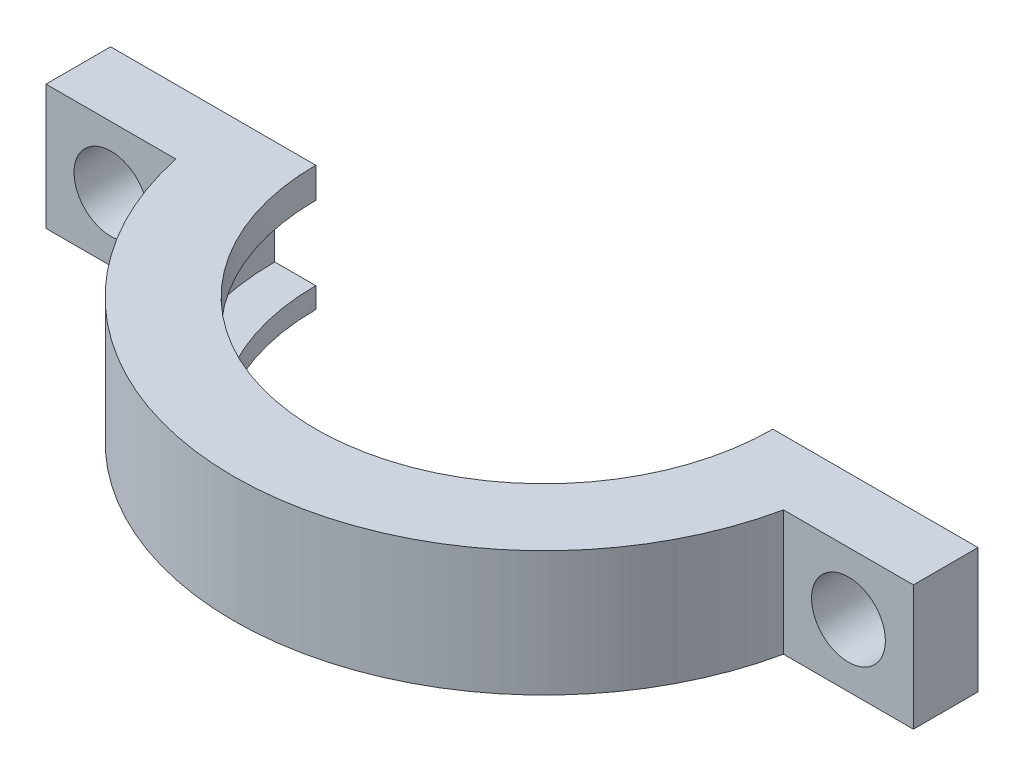
ISO-10303-21;
HEADER;
FILE_DESCRIPTION(('STEP AP214'),'2;1');
FILE_NAME('part.step','',(''),(''),'','','');
FILE_SCHEMA(('AUTOMOTIVE_DESIGN { 1 0 10303 214 1 1 1 1 }'));
ENDSEC;
DATA;
#1=APPLICATION_CONTEXT('core data for automotive mechanical design processes');
#2=APPLICATION_PROTOCOL_DEFINITION('international standard','automotive_design',2000,#1);
#3=PRODUCT_CONTEXT('',#1,'mechanical');
#4=PRODUCT('Part','Part','',(#3));
#5=PRODUCT_RELATED_PRODUCT_CATEGORY('part','',(#4));
#6=PRODUCT_DEFINITION_FORMATION('','',#4);
#7=PRODUCT_DEFINITION_CONTEXT('part definition',#1,'design');
#8=PRODUCT_DEFINITION('design','',#6,#7);
#9=PRODUCT_DEFINITION_SHAPE('','',#8);
#10=(LENGTH_UNIT() NAMED_UNIT(*) SI_UNIT(.MILLI.,.METRE.));
#11=(NAMED_UNIT(*) PLANE_ANGLE_UNIT() SI_UNIT($,.RADIAN.));
#12=(NAMED_UNIT(*) SI_UNIT($,.STERADIAN.) SOLID_ANGLE_UNIT());
#13=UNCERTAINTY_MEASURE_WITH_UNIT(LENGTH_MEASURE(1.E-05),#10,'distance_accuracy_value','');
#14=(GEOMETRIC_REPRESENTATION_CONTEXT(3) GLOBAL_UNCERTAINTY_ASSIGNED_CONTEXT((#13)) GLOBAL_UNIT_ASSIGNED_CONTEXT((#10,
#11,#12)) REPRESENTATION_CONTEXT('',''));
#15=CARTESIAN_POINT('',(0.,0.,0.));
#16=DIRECTION('',(0.,0.,1.));
#17=DIRECTION('',(1.,0.,0.));
#18=AXIS2_PLACEMENT_3D('',#15,#16,#17);
#19=CARTESIAN_POINT('',(-49.7442644411717,0.,0.));
#20=DIRECTION('',(0.,-1.,0.));
#21=DIRECTION('',(0.,0.,-1.));
#22=AXIS2_PLACEMENT_3D('',#19,#20,#21);
#23=CYLINDRICAL_SURFACE('',#22,15.1402673023807);
#24=CARTESIAN_POINT('',(-49.7442644411717,11.7337288164038,0.));
#25=DIRECTION('',(0.,-1.,0.));
#26=DIRECTION('',(0.,0.,-1.));
#27=AXIS2_PLACEMENT_3D('',#24,#25,#26);
#28=CIRCLE('',#27,15.1402673023807);
#29=CARTESIAN_POINT('',(-34.9353078949616,11.7337288164038,3.15000000000001));
#30=VERTEX_POINT('',#29);
#31=CARTESIAN_POINT('',(-64.5532209873817,11.7337288164038,3.15));
#32=VERTEX_POINT('',#31);
#33=EDGE_CURVE('E12',#30,#32,#28,.T.);
#34=ORIENTED_EDGE('',*,*,#33,.T.);
#35=DIRECTION('',(0.,1.,0.));
#36=VECTOR('',#35,1.);
#37=CARTESIAN_POINT('',(-64.5532209873817,-3.29191368207121,3.15));
#38=LINE('',#37,#36);
#39=CARTESIAN_POINT('',(-64.5532209873817,5.63979924945554,3.15));
#40=VERTEX_POINT('',#39);
#41=EDGE_CURVE('E176',#40,#32,#38,.T.);
#42=ORIENTED_EDGE('',*,*,#41,.F.);
#43=CARTESIAN_POINT('',(-49.7442644411717,5.63979924945554,0.));
#44=DIRECTION('',(0.,-1.,0.));
#45=DIRECTION('',(0.,0.,-1.));
#46=AXIS2_PLACEMENT_3D('',#43,#44,#45);
#47=CIRCLE('',#46,15.1402673023807);
#48=CARTESIAN_POINT('',(-34.9353078949616,5.63979924945554,3.15000000000001));
#49=VERTEX_POINT('',#48);
#50=EDGE_CURVE('E57',#49,#40,#47,.T.);
#51=ORIENTED_EDGE('',*,*,#50,.F.);
#52=DIRECTION('',(0.,1.,0.));
#53=VECTOR('',#52,1.);
#54=CARTESIAN_POINT('',(-34.9353078949616,-3.29191368207121,3.15000000000001));
#55=LINE('',#54,#53);
#56=EDGE_CURVE('E188',#49,#30,#55,.T.);
#57=ORIENTED_EDGE('',*,*,#56,.T.);
#58=EDGE_LOOP('',(#34,#42,#51,#57));
#59=FACE_BOUND('',#58,.T.);
#60=ADVANCED_FACE('F47',(#59),#23,.T.);
#61=CARTESIAN_POINT('',(-28.603997138791,-3.29191368207121,3.15000000000001));
#62=DIRECTION('',(1.,0.,0.));
#63=DIRECTION('',(0.,0.,-1.));
#64=AXIS2_PLACEMENT_3D('',#61,#62,#63);
#65=PLANE('',#64);
#66=DIRECTION('',(0.,-1.,0.));
#67=VECTOR('',#66,1.);
#68=CARTESIAN_POINT('',(-28.603997138791,-3.29191368207121,0.));
#69=LINE('',#68,#67);
#70=CARTESIAN_POINT('',(-28.603997138791,11.7337288164038,0.));
#71=VERTEX_POINT('',#70);
#72=CARTESIAN_POINT('',(-28.603997138791,5.63979924945554,0.));
#73=VERTEX_POINT('',#72);
#74=EDGE_CURVE('E239',#71,#73,#69,.T.);
#75=ORIENTED_EDGE('',*,*,#74,.F.);
#76=DIRECTION('',(0.,0.,-1.));
#77=VECTOR('',#76,1.);
#78=CARTESIAN_POINT('',(-28.603997138791,11.7337288164038,3.15000000000001));
#79=LINE('',#78,#77);
#80=CARTESIAN_POINT('',(-28.603997138791,11.7337288164038,3.15000000000001));
#81=VERTEX_POINT('',#80);
#82=EDGE_CURVE('E170',#81,#71,#79,.T.);
#83=ORIENTED_EDGE('',*,*,#82,.F.);
#84=DIRECTION('',(0.,1.,0.));
#85=VECTOR('',#84,1.);
#86=CARTESIAN_POINT('',(-28.603997138791,-3.29191368207121,3.15000000000001));
#87=LINE('',#86,#85);
#88=CARTESIAN_POINT('',(-28.603997138791,5.63979924945554,3.15000000000001));
#89=VERTEX_POINT('',#88);
#90=EDGE_CURVE('E192',#89,#81,#87,.T.);
#91=ORIENTED_EDGE('',*,*,#90,.F.);
#92=DIRECTION('',(0.,0.,1.));
#93=VECTOR('',#92,1.);
#94=CARTESIAN_POINT('',(-28.603997138791,5.63979924945554,3.15000000000001));
#95=LINE('',#94,#93);
#96=EDGE_CURVE('E186',#73,#89,#95,.T.);
#97=ORIENTED_EDGE('',*,*,#96,.F.);
#98=EDGE_LOOP('',(#75,#83,#91,#97));
#99=FACE_BOUND('',#98,.T.);
#100=ADVANCED_FACE('F238',(#99),#65,.T.);
#101=CARTESIAN_POINT('',(-49.7442644411717,0.,0.));
#102=DIRECTION('',(0.,-1.,0.));
#103=DIRECTION('',(0.,0.,-1.));
#104=AXIS2_PLACEMENT_3D('',#101,#102,#103);
#105=CYLINDRICAL_SURFACE('',#104,11.1402673023807);
#106=CARTESIAN_POINT('',(-49.7442644411717,10.2506791032564,0.));
#107=DIRECTION('',(0.,-1.,0.));
#108=DIRECTION('',(0.,0.,-1.));
#109=AXIS2_PLACEMENT_3D('',#106,#107,#108);
#110=CIRCLE('',#109,11.1402673023807);
#111=CARTESIAN_POINT('',(-38.603997138791,10.2506791032564,0.));
#112=VERTEX_POINT('',#111);
#113=CARTESIAN_POINT('',(-60.8845317435524,10.2506791032564,0.));
#114=VERTEX_POINT('',#113);
#115=EDGE_CURVE('E201',#112,#114,#110,.T.);
#116=ORIENTED_EDGE('',*,*,#115,.T.);
#117=DIRECTION('',(0.,-1.,0.));
#118=VECTOR('',#117,1.);
#119=CARTESIAN_POINT('',(-60.8845317435524,0.,0.));
#120=LINE('',#119,#118);
#121=CARTESIAN_POINT('',(-60.8845317435524,11.7337288164038,0.));
#122=VERTEX_POINT('',#121);
#123=EDGE_CURVE('E156',#114,#122,#120,.F.);
#124=ORIENTED_EDGE('',*,*,#123,.T.);
#125=CARTESIAN_POINT('',(-49.7442644411717,11.7337288164038,0.));
#126=DIRECTION('',(0.,-1.,0.));
#127=DIRECTION('',(0.,0.,-1.));
#128=AXIS2_PLACEMENT_3D('',#125,#126,#127);
#129=CIRCLE('',#128,11.1402673023807);
#130=CARTESIAN_POINT('',(-38.603997138791,11.7337288164038,0.));
#131=VERTEX_POINT('',#130);
#132=EDGE_CURVE('E154',#131,#122,#129,.T.);
#133=ORIENTED_EDGE('',*,*,#132,.F.);
#134=DIRECTION('',(0.,-1.,0.));
#135=VECTOR('',#134,1.);
#136=CARTESIAN_POINT('',(-38.603997138791,0.,0.));
#137=LINE('',#136,#135);
#138=EDGE_CURVE('E253',#131,#112,#137,.T.);
#139=ORIENTED_EDGE('',*,*,#138,.T.);
#140=EDGE_LOOP('',(#116,#124,#133,#139));
#141=FACE_BOUND('',#140,.T.);
#142=ADVANCED_FACE('F326',(#141),#105,.F.);
#143=CARTESIAN_POINT('',(-62.8845317435524,10.2506791032564,0.));
#144=DIRECTION('',(0.,1.,0.));
#145=DIRECTION('',(0.,0.,1.));
#146=AXIS2_PLACEMENT_3D('',#143,#144,#145);
#147=PLANE('',#146);
#148=CARTESIAN_POINT('',(-49.7442644411717,10.2506791032564,0.));
#149=DIRECTION('',(0.,-1.,0.));
#150=DIRECTION('',(0.,0.,-1.));
#151=AXIS2_PLACEMENT_3D('',#148,#149,#150);
#152=CIRCLE('',#151,13.1402673023807);
#153=CARTESIAN_POINT('',(-36.603997138791,10.2506791032564,0.));
#154=VERTEX_POINT('',#153);
#155=CARTESIAN_POINT('',(-62.8845317435524,10.2506791032564,0.));
#156=VERTEX_POINT('',#155);
#157=EDGE_CURVE('E205',#154,#156,#152,.T.);
#158=ORIENTED_EDGE('',*,*,#157,.T.);
#159=DIRECTION('',(1.,0.,0.));
#160=VECTOR('',#159,1.);
#161=CARTESIAN_POINT('',(-62.8845317435524,10.2506791032564,0.));
#162=LINE('',#161,#160);
#163=EDGE_CURVE('E292',#156,#114,#162,.T.);
#164=ORIENTED_EDGE('',*,*,#163,.T.);
#165=ORIENTED_EDGE('',*,*,#115,.F.);
#166=EDGE_CURVE('E257',#112,#154,#162,.T.);
#167=ORIENTED_EDGE('',*,*,#166,.T.);
#168=EDGE_LOOP('',(#158,#164,#165,#167));
#169=FACE_BOUND('',#168,.T.);
#170=ADVANCED_FACE('F338',(#169),#147,.F.);
#171=CARTESIAN_POINT('',(-49.7442644411717,0.,0.));
#172=DIRECTION('',(0.,-1.,0.));
#173=DIRECTION('',(0.,0.,-1.));
#174=AXIS2_PLACEMENT_3D('',#171,#172,#173);
#175=CYLINDRICAL_SURFACE('',#174,13.1402673023807);
#176=CARTESIAN_POINT('',(-49.7442644411717,6.65067910325642,0.));
#177=DIRECTION('',(0.,-1.,0.));
#178=DIRECTION('',(0.,0.,-1.));
#179=AXIS2_PLACEMENT_3D('',#176,#177,#178);
#180=CIRCLE('',#179,13.1402673023807);
#181=CARTESIAN_POINT('',(-36.603997138791,6.65067910325642,0.));
#182=VERTEX_POINT('',#181);
#183=CARTESIAN_POINT('',(-62.8845317435524,6.65067910325642,0.));
#184=VERTEX_POINT('',#183);
#185=EDGE_CURVE('E209',#182,#184,#180,.T.);
#186=ORIENTED_EDGE('',*,*,#185,.T.);
#187=DIRECTION('',(0.,-1.,0.));
#188=VECTOR('',#187,1.);
#189=CARTESIAN_POINT('',(-62.8845317435524,0.,0.));
#190=LINE('',#189,#188);
#191=EDGE_CURVE('E289',#184,#156,#190,.F.);
#192=ORIENTED_EDGE('',*,*,#191,.T.);
#193=ORIENTED_EDGE('',*,*,#157,.F.);
#194=DIRECTION('',(0.,-1.,0.));
#195=VECTOR('',#194,1.);
#196=CARTESIAN_POINT('',(-36.603997138791,0.,0.));
#197=LINE('',#196,#195);
#198=EDGE_CURVE('E258',#154,#182,#197,.T.);
#199=ORIENTED_EDGE('',*,*,#198,.T.);
#200=EDGE_LOOP('',(#186,#192,#193,#199));
#201=FACE_BOUND('',#200,.T.);
#202=ADVANCED_FACE('F335',(#201),#175,.F.);
#203=CARTESIAN_POINT('',(-60.8845317435524,6.65067910325642,0.));
#204=DIRECTION('',(0.,-1.,0.));
#205=DIRECTION('',(0.,0.,-1.));
#206=AXIS2_PLACEMENT_3D('',#203,#204,#205);
#207=PLANE('',#206);
#208=ORIENTED_EDGE('',*,*,#185,.F.);
#209=DIRECTION('',(-1.,0.,0.));
#210=VECTOR('',#209,1.);
#211=CARTESIAN_POINT('',(-60.8845317435524,6.65067910325642,0.));
#212=LINE('',#211,#210);
#213=CARTESIAN_POINT('',(-38.603997138791,6.65067910325642,0.));
#214=VERTEX_POINT('',#213);
#215=EDGE_CURVE('E262',#182,#214,#212,.T.);
#216=ORIENTED_EDGE('',*,*,#215,.T.);
#217=CARTESIAN_POINT('',(-49.7442644411717,6.65067910325642,0.));
#218=DIRECTION('',(0.,-1.,0.));
#219=DIRECTION('',(0.,0.,-1.));
#220=AXIS2_PLACEMENT_3D('',#217,#218,#219);
#221=CIRCLE('',#220,11.1402673023807);
#222=CARTESIAN_POINT('',(-60.8845317435524,6.65067910325642,0.));
#223=VERTEX_POINT('',#222);
#224=EDGE_CURVE('E213',#214,#223,#221,.T.);
#225=ORIENTED_EDGE('',*,*,#224,.T.);
#226=EDGE_CURVE('E249',#223,#184,#212,.T.);
#227=ORIENTED_EDGE('',*,*,#226,.T.);
#228=EDGE_LOOP('',(#208,#216,#225,#227));
#229=FACE_BOUND('',#228,.T.);
#230=ADVANCED_FACE('F284',(#229),#207,.F.);
#231=CARTESIAN_POINT('',(-49.7442644411717,0.,0.));
#232=DIRECTION('',(0.,-1.,0.));
#233=DIRECTION('',(0.,0.,-1.));
#234=AXIS2_PLACEMENT_3D('',#231,#232,#233);
#235=CYLINDRICAL_SURFACE('',#234,11.1402673023807);
#236=CARTESIAN_POINT('',(-49.7442644411717,5.63979924945554,0.));
#237=DIRECTION('',(0.,-1.,0.));
#238=DIRECTION('',(0.,0.,-1.));
#239=AXIS2_PLACEMENT_3D('',#236,#237,#238);
#240=CIRCLE('',#239,11.1402673023807);
#241=CARTESIAN_POINT('',(-38.603997138791,5.63979924945554,0.));
#242=VERTEX_POINT('',#241);
#243=CARTESIAN_POINT('',(-60.8845317435524,5.63979924945554,0.));
#244=VERTEX_POINT('',#243);
#245=EDGE_CURVE('E217',#242,#244,#240,.T.);
#246=ORIENTED_EDGE('',*,*,#245,.T.);
#247=DIRECTION('',(0.,-1.,0.));
#248=VECTOR('',#247,1.);
#249=CARTESIAN_POINT('',(-60.8845317435524,0.,0.));
#250=LINE('',#249,#248);
#251=EDGE_CURVE('E243',#244,#223,#250,.F.);
#252=ORIENTED_EDGE('',*,*,#251,.T.);
#253=ORIENTED_EDGE('',*,*,#224,.F.);
#254=DIRECTION('',(0.,-1.,0.));
#255=VECTOR('',#254,1.);
#256=CARTESIAN_POINT('',(-38.603997138791,0.,0.));
#257=LINE('',#256,#255);
#258=EDGE_CURVE('E263',#214,#242,#257,.T.);
#259=ORIENTED_EDGE('',*,*,#258,.T.);
#260=EDGE_LOOP('',(#246,#252,#253,#259));
#261=FACE_BOUND('',#260,.T.);
#262=ADVANCED_FACE('F278',(#261),#235,.F.);
#263=CARTESIAN_POINT('',(-70.8845317435524,-3.29191368207121,-3.15));
#264=DIRECTION('',(-1.,0.,0.));
#265=DIRECTION('',(0.,0.,1.));
#266=AXIS2_PLACEMENT_3D('',#263,#264,#265);
#267=PLANE('',#266);
#268=DIRECTION('',(0.,1.,0.));
#269=VECTOR('',#268,1.);
#270=CARTESIAN_POINT('',(-70.8845317435524,-3.29191368207121,0.));
#271=LINE('',#270,#269);
#272=CARTESIAN_POINT('',(-70.8845317435524,5.63979924945554,0.));
#273=VERTEX_POINT('',#272);
#274=CARTESIAN_POINT('',(-70.8845317435524,11.7337288164038,0.));
#275=VERTEX_POINT('',#274);
#276=EDGE_CURVE('E135',#273,#275,#271,.T.);
#277=ORIENTED_EDGE('',*,*,#276,.F.);
#278=DIRECTION('',(0.,0.,-1.));
#279=VECTOR('',#278,1.);
#280=CARTESIAN_POINT('',(-70.8845317435524,5.63979924945554,-3.15));
#281=LINE('',#280,#279);
#282=CARTESIAN_POINT('',(-70.8845317435524,5.63979924945554,3.15));
#283=VERTEX_POINT('',#282);
#284=EDGE_CURVE('E179',#283,#273,#281,.T.);
#285=ORIENTED_EDGE('',*,*,#284,.F.);
#286=DIRECTION('',(0.,1.,0.));
#287=VECTOR('',#286,1.);
#288=CARTESIAN_POINT('',(-70.8845317435524,-3.29191368207121,3.15));
#289=LINE('',#288,#287);
#290=CARTESIAN_POINT('',(-70.8845317435524,11.7337288164038,3.15));
#291=VERTEX_POINT('',#290);
#292=EDGE_CURVE('E160',#283,#291,#289,.T.);
#293=ORIENTED_EDGE('',*,*,#292,.T.);
#294=DIRECTION('',(0.,0.,1.));
#295=VECTOR('',#294,1.);
#296=CARTESIAN_POINT('',(-70.8845317435524,11.7337288164038,-3.15));
#297=LINE('',#296,#295);
#298=EDGE_CURVE('E151',#275,#291,#297,.T.);
#299=ORIENTED_EDGE('',*,*,#298,.F.);
#300=EDGE_LOOP('',(#277,#285,#293,#299));
#301=FACE_BOUND('',#300,.T.);
#302=ADVANCED_FACE('F158',(#301),#267,.T.);
#303=CARTESIAN_POINT('',(-64.8845317435524,5.63979924945554,0.));
#304=DIRECTION('',(0.,1.,0.));
#305=DIRECTION('',(0.,0.,1.));
#306=AXIS2_PLACEMENT_3D('',#303,#304,#305);
#307=PLANE('',#306);
#308=ORIENTED_EDGE('',*,*,#284,.T.);
#309=DIRECTION('',(1.,0.,0.));
#310=VECTOR('',#309,1.);
#311=CARTESIAN_POINT('',(-64.8845317435524,5.63979924945554,0.));
#312=LINE('',#311,#310);
#313=EDGE_CURVE('E72',#273,#244,#312,.T.);
#314=ORIENTED_EDGE('',*,*,#313,.T.);
#315=ORIENTED_EDGE('',*,*,#245,.F.);
#316=EDGE_CURVE('E242',#242,#73,#312,.T.);
#317=ORIENTED_EDGE('',*,*,#316,.T.);
#318=ORIENTED_EDGE('',*,*,#96,.T.);
#319=DIRECTION('',(-1.,0.,0.));
#320=VECTOR('',#319,1.);
#321=CARTESIAN_POINT('',(-34.9353078949616,5.63979924945554,3.15000000000001));
#322=LINE('',#321,#320);
#323=EDGE_CURVE('E182',#89,#49,#322,.T.);
#324=ORIENTED_EDGE('',*,*,#323,.T.);
#325=ORIENTED_EDGE('',*,*,#50,.T.);
#326=DIRECTION('',(-1.,0.,0.));
#327=VECTOR('',#326,1.);
#328=CARTESIAN_POINT('',(-70.8845317435524,5.63979924945554,3.15));
#329=LINE('',#328,#327);
#330=EDGE_CURVE('E173',#40,#283,#329,.T.);
#331=ORIENTED_EDGE('',*,*,#330,.T.);
#332=EDGE_LOOP('',(#308,#314,#315,#317,#318,#324,#325,#331));
#333=FACE_BOUND('',#332,.T.);
#334=ADVANCED_FACE('F225',(#333),#307,.F.);
#335=CARTESIAN_POINT('',(-62.6942644411717,11.7337288164038,0.));
#336=DIRECTION('',(0.,-1.,0.));
#337=DIRECTION('',(0.,0.,-1.));
#338=AXIS2_PLACEMENT_3D('',#335,#336,#337);
#339=PLANE('',#338);
#340=ORIENTED_EDGE('',*,*,#82,.T.);
#341=DIRECTION('',(-1.,0.,0.));
#342=VECTOR('',#341,1.);
#343=CARTESIAN_POINT('',(-62.6942644411717,11.7337288164038,0.));
#344=LINE('',#343,#342);
#345=EDGE_CURVE('E64',#71,#131,#344,.T.);
#346=ORIENTED_EDGE('',*,*,#345,.T.);
#347=ORIENTED_EDGE('',*,*,#132,.T.);
#348=EDGE_CURVE('E138',#122,#275,#344,.T.);
#349=ORIENTED_EDGE('',*,*,#348,.T.);
#350=ORIENTED_EDGE('',*,*,#298,.T.);
#351=DIRECTION('',(1.,0.,0.));
#352=VECTOR('',#351,1.);
#353=CARTESIAN_POINT('',(-70.8845317435524,11.7337288164038,3.15));
#354=LINE('',#353,#352);
#355=EDGE_CURVE('E163',#291,#32,#354,.T.);
#356=ORIENTED_EDGE('',*,*,#355,.T.);
#357=ORIENTED_EDGE('',*,*,#33,.F.);
#358=DIRECTION('',(1.,0.,0.));
#359=VECTOR('',#358,1.);
#360=CARTESIAN_POINT('',(-34.9353078949616,11.7337288164038,3.15000000000001));
#361=LINE('',#360,#359);
#362=EDGE_CURVE('E164',#30,#81,#361,.T.);
#363=ORIENTED_EDGE('',*,*,#362,.T.);
#364=EDGE_LOOP('',(#340,#346,#347,#349,#350,#356,#357,#363));
#365=FACE_BOUND('',#364,.T.);
#366=ADVANCED_FACE('F49',(#365),#339,.F.);
#367=CARTESIAN_POINT('',(-34.9353078949616,-3.29191368207121,3.15000000000001));
#368=DIRECTION('',(0.,0.,1.));
#369=DIRECTION('',(1.,0.,0.));
#370=AXIS2_PLACEMENT_3D('',#367,#368,#369);
#371=PLANE('',#370);
#372=CARTESIAN_POINT('',(-31.7696525168763,8.68676403292968,3.15000000000002));
#373=DIRECTION('',(0.,0.,1.));
#374=DIRECTION('',(1.,0.,0.));
#375=AXIS2_PLACEMENT_3D('',#372,#373,#374);
#376=CIRCLE('',#375,1.8);
#377=CARTESIAN_POINT('',(-29.9696525168763,8.68676403292968,3.15000000000002));
#378=VERTEX_POINT('',#377);
#379=EDGE_CURVE('E267',#378,#378,#376,.T.);
#380=ORIENTED_EDGE('',*,*,#379,.F.);
#381=EDGE_LOOP('',(#380));
#382=FACE_BOUND('',#381,.T.);
#383=ORIENTED_EDGE('',*,*,#323,.F.);
#384=ORIENTED_EDGE('',*,*,#90,.T.);
#385=ORIENTED_EDGE('',*,*,#362,.F.);
#386=ORIENTED_EDGE('',*,*,#56,.F.);
#387=EDGE_LOOP('',(#383,#384,#385,#386));
#388=FACE_BOUND('',#387,.T.);
#389=ADVANCED_FACE('F234',(#382,#388),#371,.T.);
#390=CARTESIAN_POINT('',(-31.7696525168763,8.68676403292968,-8.24116882454315));
#391=DIRECTION('',(0.,0.,1.));
#392=DIRECTION('',(1.,0.,0.));
#393=AXIS2_PLACEMENT_3D('',#390,#391,#392);
#394=CYLINDRICAL_SURFACE('',#393,1.8);
#395=CARTESIAN_POINT('',(-31.7696525168763,8.68676403292968,0.));
#396=DIRECTION('',(0.,0.,1.));
#397=DIRECTION('',(1.,0.,0.));
#398=AXIS2_PLACEMENT_3D('',#395,#396,#397);
#399=CIRCLE('',#398,1.8);
#400=CARTESIAN_POINT('',(-29.9696525168763,8.68676403292968,0.));
#401=VERTEX_POINT('',#400);
#402=EDGE_CURVE('E51',#401,#401,#399,.F.);
#403=ORIENTED_EDGE('',*,*,#402,.T.);
#404=EDGE_LOOP('',(#403));
#405=FACE_BOUND('',#404,.T.);
#406=ORIENTED_EDGE('',*,*,#379,.T.);
#407=EDGE_LOOP('',(#406));
#408=FACE_BOUND('',#407,.T.);
#409=ADVANCED_FACE('F309',(#405,#408),#394,.F.);
#410=CARTESIAN_POINT('',(-70.8845317435524,-3.29191368207121,3.15));
#411=DIRECTION('',(0.,0.,1.));
#412=DIRECTION('',(1.,0.,0.));
#413=AXIS2_PLACEMENT_3D('',#410,#411,#412);
#414=PLANE('',#413);
#415=CARTESIAN_POINT('',(-67.7188763654671,8.68676403292968,3.15000000000002));
#416=DIRECTION('',(0.,0.,1.));
#417=DIRECTION('',(1.,0.,0.));
#418=AXIS2_PLACEMENT_3D('',#415,#416,#417);
#419=CIRCLE('',#418,1.79999999999999);
#420=CARTESIAN_POINT('',(-65.9188763654671,8.68676403292968,3.15000000000002));
#421=VERTEX_POINT('',#420);
#422=EDGE_CURVE('E187',#421,#421,#419,.T.);
#423=ORIENTED_EDGE('',*,*,#422,.F.);
#424=EDGE_LOOP('',(#423));
#425=FACE_BOUND('',#424,.T.);
#426=ORIENTED_EDGE('',*,*,#330,.F.);
#427=ORIENTED_EDGE('',*,*,#41,.T.);
#428=ORIENTED_EDGE('',*,*,#355,.F.);
#429=ORIENTED_EDGE('',*,*,#292,.F.);
#430=EDGE_LOOP('',(#426,#427,#428,#429));
#431=FACE_BOUND('',#430,.T.);
#432=ADVANCED_FACE('F231',(#425,#431),#414,.T.);
#433=CARTESIAN_POINT('',(-67.7188763654671,8.68676403292968,-8.24116882454315));
#434=DIRECTION('',(0.,0.,1.));
#435=DIRECTION('',(1.,0.,0.));
#436=AXIS2_PLACEMENT_3D('',#433,#434,#435);
#437=CYLINDRICAL_SURFACE('',#436,1.79999999999999);
#438=CARTESIAN_POINT('',(-67.7188763654671,8.68676403292968,0.));
#439=DIRECTION('',(0.,0.,1.));
#440=DIRECTION('',(1.,0.,0.));
#441=AXIS2_PLACEMENT_3D('',#438,#439,#440);
#442=CIRCLE('',#441,1.79999999999999);
#443=CARTESIAN_POINT('',(-65.9188763654671,8.68676403292968,0.));
#444=VERTEX_POINT('',#443);
#445=EDGE_CURVE('E145',#444,#444,#442,.F.);
#446=ORIENTED_EDGE('',*,*,#445,.T.);
#447=EDGE_LOOP('',(#446));
#448=FACE_BOUND('',#447,.T.);
#449=ORIENTED_EDGE('',*,*,#422,.T.);
#450=EDGE_LOOP('',(#449));
#451=FACE_BOUND('',#450,.T.);
#452=ADVANCED_FACE('F313',(#448,#451),#437,.F.);
#453=CARTESIAN_POINT('',(-23.4421170692061,-7.04627118359618,0.));
#454=DIRECTION('',(0.,0.,1.));
#455=DIRECTION('',(1.,0.,0.));
#456=AXIS2_PLACEMENT_3D('',#453,#454,#455);
#457=PLANE('',#456);
#458=ORIENTED_EDGE('',*,*,#402,.F.);
#459=EDGE_LOOP('',(#458));
#460=FACE_BOUND('',#459,.T.);
#461=ORIENTED_EDGE('',*,*,#215,.F.);
#462=ORIENTED_EDGE('',*,*,#198,.F.);
#463=ORIENTED_EDGE('',*,*,#166,.F.);
#464=ORIENTED_EDGE('',*,*,#138,.F.);
#465=ORIENTED_EDGE('',*,*,#345,.F.);
#466=ORIENTED_EDGE('',*,*,#74,.T.);
#467=ORIENTED_EDGE('',*,*,#316,.F.);
#468=ORIENTED_EDGE('',*,*,#258,.F.);
#469=EDGE_LOOP('',(#461,#462,#463,#464,#465,#466,#467,#468));
#470=FACE_BOUND('',#469,.T.);
#471=ADVANCED_FACE('F281',(#460,#470),#457,.F.);
#472=ORIENTED_EDGE('',*,*,#445,.F.);
#473=EDGE_LOOP('',(#472));
#474=FACE_BOUND('',#473,.T.);
#475=ORIENTED_EDGE('',*,*,#313,.F.);
#476=ORIENTED_EDGE('',*,*,#276,.T.);
#477=ORIENTED_EDGE('',*,*,#348,.F.);
#478=ORIENTED_EDGE('',*,*,#123,.F.);
#479=ORIENTED_EDGE('',*,*,#163,.F.);
#480=ORIENTED_EDGE('',*,*,#191,.F.);
#481=ORIENTED_EDGE('',*,*,#226,.F.);
#482=ORIENTED_EDGE('',*,*,#251,.F.);
#483=EDGE_LOOP('',(#475,#476,#477,#478,#479,#480,#481,#482));
#484=FACE_BOUND('',#483,.T.);
#485=ADVANCED_FACE('F137',(#474,#484),#457,.F.);
#486=CLOSED_SHELL('',(#60,#100,#142,#170,#202,#230,#262,#302,#334,#366,#389,#409,#432,#452,#471,#485));
#487=MANIFOLD_SOLID_BREP('B2',#486);
#488=ADVANCED_BREP_SHAPE_REPRESENTATION('',(#18,#487),#14);
#489=SHAPE_DEFINITION_REPRESENTATION(#9,#488);
ENDSEC;
END-ISO-10303-21;
